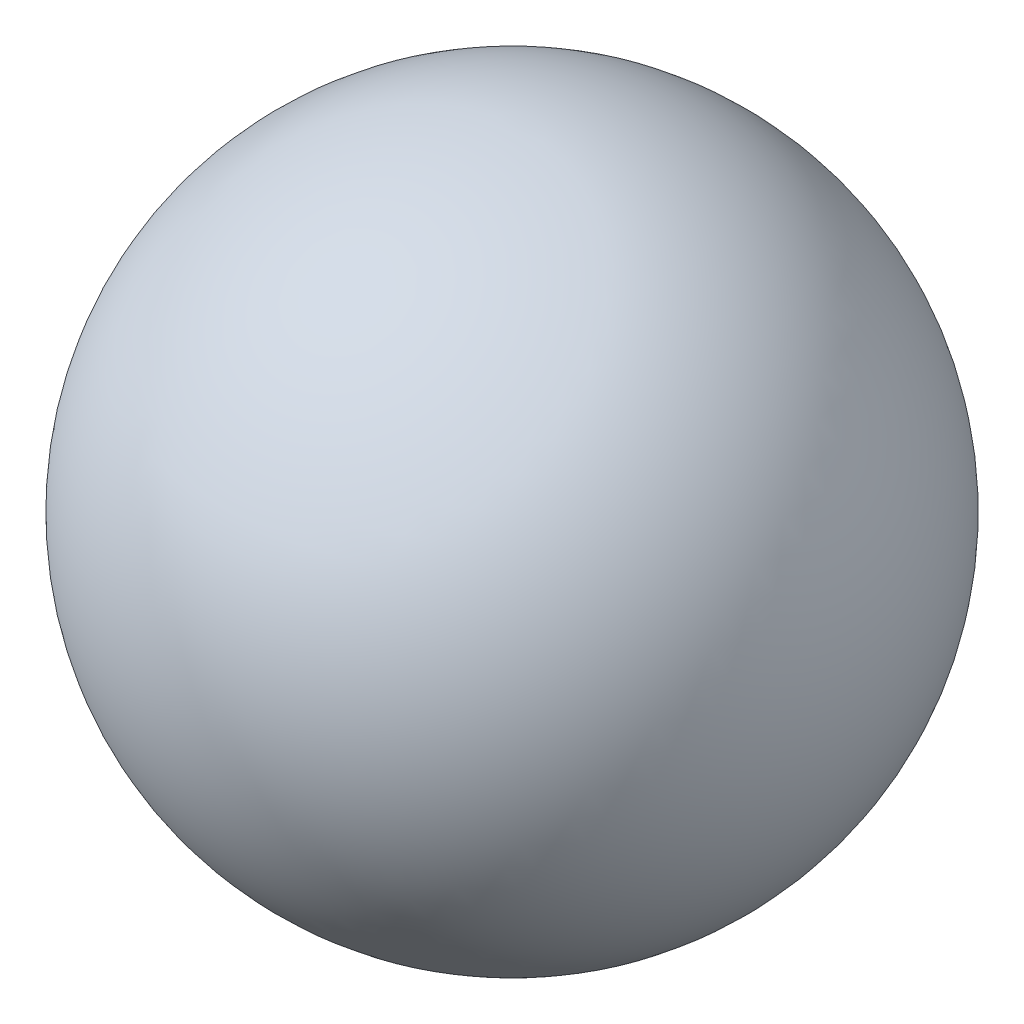
ISO-10303-21;
HEADER;
FILE_DESCRIPTION(('STEP AP214'),'2;1');
FILE_NAME('part.step','',(''),(''),'','','');
FILE_SCHEMA(('AUTOMOTIVE_DESIGN { 1 0 10303 214 1 1 1 1 }'));
ENDSEC;
DATA;
#1=APPLICATION_CONTEXT('core data for automotive mechanical design processes');
#2=APPLICATION_PROTOCOL_DEFINITION('international standard','automotive_design',2000,#1);
#3=PRODUCT_CONTEXT('',#1,'mechanical');
#4=PRODUCT('Part','Part','',(#3));
#5=PRODUCT_RELATED_PRODUCT_CATEGORY('part','',(#4));
#6=PRODUCT_DEFINITION_FORMATION('','',#4);
#7=PRODUCT_DEFINITION_CONTEXT('part definition',#1,'design');
#8=PRODUCT_DEFINITION('design','',#6,#7);
#9=PRODUCT_DEFINITION_SHAPE('','',#8);
#10=(LENGTH_UNIT() NAMED_UNIT(*) SI_UNIT(.MILLI.,.METRE.));
#11=(NAMED_UNIT(*) PLANE_ANGLE_UNIT() SI_UNIT($,.RADIAN.));
#12=(NAMED_UNIT(*) SI_UNIT($,.STERADIAN.) SOLID_ANGLE_UNIT());
#13=UNCERTAINTY_MEASURE_WITH_UNIT(LENGTH_MEASURE(1.E-05),#10,'distance_accuracy_value','');
#14=(GEOMETRIC_REPRESENTATION_CONTEXT(3) GLOBAL_UNCERTAINTY_ASSIGNED_CONTEXT((#13)) GLOBAL_UNIT_ASSIGNED_CONTEXT((#10,
#11,#12)) REPRESENTATION_CONTEXT('',''));
#15=CARTESIAN_POINT('',(0.,0.,0.));
#16=DIRECTION('',(0.,0.,1.));
#17=DIRECTION('',(1.,0.,0.));
#18=AXIS2_PLACEMENT_3D('',#15,#16,#17);
#19=CARTESIAN_POINT('',(0.,0.,0.));
#20=DIRECTION('',(0.,1.,0.));
#21=DIRECTION('',(1.,0.,0.));
#22=AXIS2_PLACEMENT_3D('',#19,#20,#21);
#23=SPHERICAL_SURFACE('',#22,1.27);
#24=CARTESIAN_POINT('',(0.,1.27,0.));
#25=VERTEX_POINT('',#24);
#26=VERTEX_LOOP('',#25);
#27=FACE_BOUND('',#26,.T.);
#28=ADVANCED_FACE('F40',(#27),#23,.T.);
#29=CLOSED_SHELL('',(#28));
#30=MANIFOLD_SOLID_BREP('B2',#29);
#31=ADVANCED_BREP_SHAPE_REPRESENTATION('',(#18,#30),#14);
#32=SHAPE_DEFINITION_REPRESENTATION(#9,#31);
ENDSEC;
END-ISO-10303-21;
